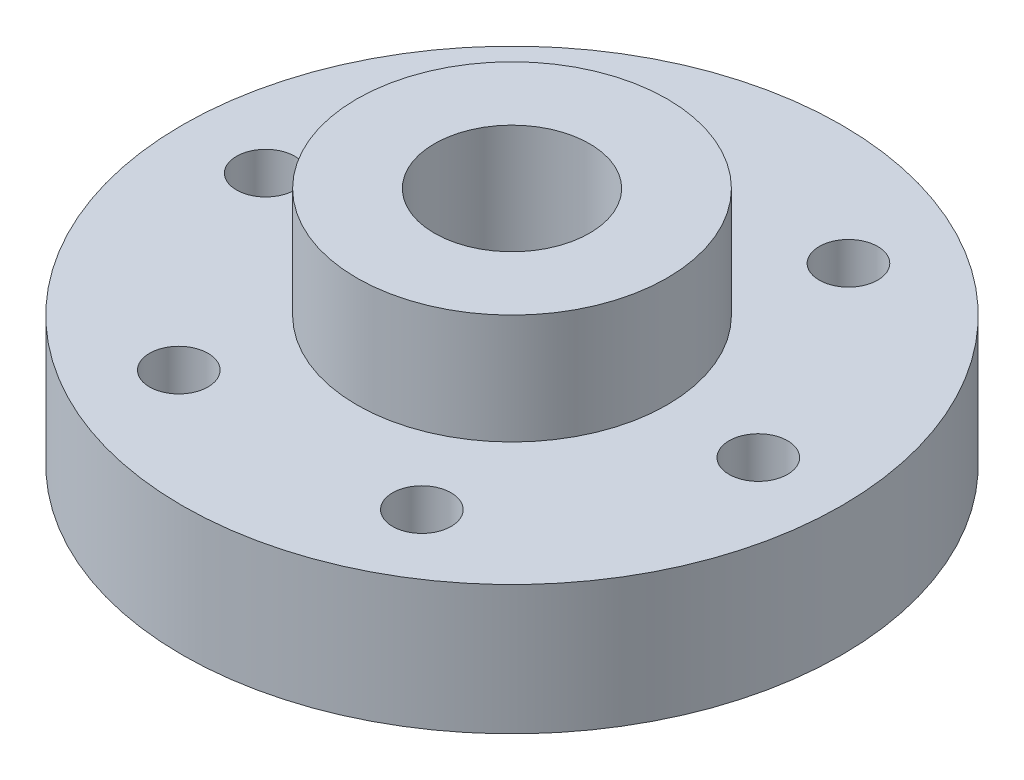
ISO-10303-21;
HEADER;
FILE_DESCRIPTION(('STEP AP214'),'2;1');
FILE_NAME('part.step','',(''),(''),'','','');
FILE_SCHEMA(('AUTOMOTIVE_DESIGN { 1 0 10303 214 1 1 1 1 }'));
ENDSEC;
DATA;
#1=APPLICATION_CONTEXT('core data for automotive mechanical design processes');
#2=APPLICATION_PROTOCOL_DEFINITION('international standard','automotive_design',2000,#1);
#3=PRODUCT_CONTEXT('',#1,'mechanical');
#4=PRODUCT('Part','Part','',(#3));
#5=PRODUCT_RELATED_PRODUCT_CATEGORY('part','',(#4));
#6=PRODUCT_DEFINITION_FORMATION('','',#4);
#7=PRODUCT_DEFINITION_CONTEXT('part definition',#1,'design');
#8=PRODUCT_DEFINITION('design','',#6,#7);
#9=PRODUCT_DEFINITION_SHAPE('','',#8);
#10=(LENGTH_UNIT() NAMED_UNIT(*) SI_UNIT(.MILLI.,.METRE.));
#11=(NAMED_UNIT(*) PLANE_ANGLE_UNIT() SI_UNIT($,.RADIAN.));
#12=(NAMED_UNIT(*) SI_UNIT($,.STERADIAN.) SOLID_ANGLE_UNIT());
#13=UNCERTAINTY_MEASURE_WITH_UNIT(LENGTH_MEASURE(1.E-05),#10,'distance_accuracy_value','');
#14=(GEOMETRIC_REPRESENTATION_CONTEXT(3) GLOBAL_UNCERTAINTY_ASSIGNED_CONTEXT((#13)) GLOBAL_UNIT_ASSIGNED_CONTEXT((#10,
#11,#12)) REPRESENTATION_CONTEXT('',''));
#15=CARTESIAN_POINT('',(0.,0.,0.));
#16=DIRECTION('',(0.,0.,1.));
#17=DIRECTION('',(1.,0.,0.));
#18=AXIS2_PLACEMENT_3D('',#15,#16,#17);
#19=CARTESIAN_POINT('',(0.,5.,0.));
#20=DIRECTION('',(0.,-1.,0.));
#21=DIRECTION('',(0.,0.,-1.));
#22=AXIS2_PLACEMENT_3D('',#19,#20,#21);
#23=CYLINDRICAL_SURFACE('',#22,12.75);
#24=CARTESIAN_POINT('',(0.,5.,0.));
#25=DIRECTION('',(0.,1.,0.));
#26=DIRECTION('',(0.,0.,1.));
#27=AXIS2_PLACEMENT_3D('',#24,#25,#26);
#28=CIRCLE('',#27,12.75);
#29=CARTESIAN_POINT('',(0.,5.,12.75));
#30=VERTEX_POINT('',#29);
#31=EDGE_CURVE('E10',#30,#30,#28,.T.);
#32=ORIENTED_EDGE('',*,*,#31,.F.);
#33=EDGE_LOOP('',(#32));
#34=FACE_BOUND('',#33,.T.);
#35=CARTESIAN_POINT('',(0.,0.,0.));
#36=DIRECTION('',(0.,1.,0.));
#37=DIRECTION('',(0.,0.,1.));
#38=AXIS2_PLACEMENT_3D('',#35,#36,#37);
#39=CIRCLE('',#38,12.75);
#40=CARTESIAN_POINT('',(0.,0.,12.75));
#41=VERTEX_POINT('',#40);
#42=EDGE_CURVE('E36',#41,#41,#39,.T.);
#43=ORIENTED_EDGE('',*,*,#42,.T.);
#44=EDGE_LOOP('',(#43));
#45=FACE_BOUND('',#44,.T.);
#46=ADVANCED_FACE('F33',(#34,#45),#23,.T.);
#47=CARTESIAN_POINT('',(0.,5.,0.));
#48=DIRECTION('',(0.,1.,0.));
#49=DIRECTION('',(0.,0.,1.));
#50=AXIS2_PLACEMENT_3D('',#47,#48,#49);
#51=PLANE('',#50);
#52=CARTESIAN_POINT('',(-4.60967748082197,5.,8.27705861141759));
#53=DIRECTION('',(0.,1.,0.));
#54=DIRECTION('',(0.,0.,1.));
#55=AXIS2_PLACEMENT_3D('',#52,#53,#54);
#56=CIRCLE('',#55,1.13029999999999);
#57=CARTESIAN_POINT('',(-4.60967748082197,5.,9.40735861141757));
#58=VERTEX_POINT('',#57);
#59=EDGE_CURVE('E89',#58,#58,#56,.T.);
#60=ORIENTED_EDGE('',*,*,#59,.F.);
#61=EDGE_LOOP('',(#60));
#62=FACE_BOUND('',#61,.T.);
#63=CARTESIAN_POINT('',(-9.525,5.,0.));
#64=DIRECTION('',(0.,1.,0.));
#65=DIRECTION('',(0.,0.,1.));
#66=AXIS2_PLACEMENT_3D('',#63,#64,#65);
#67=CIRCLE('',#66,1.13029999999999);
#68=CARTESIAN_POINT('',(-9.525,5.,1.13029999999999));
#69=VERTEX_POINT('',#68);
#70=EDGE_CURVE('E83',#69,#69,#67,.T.);
#71=ORIENTED_EDGE('',*,*,#70,.F.);
#72=EDGE_LOOP('',(#71));
#73=FACE_BOUND('',#72,.T.);
#74=CARTESIAN_POINT('',(4.7625,5.,8.24889197104678));
#75=DIRECTION('',(0.,1.,0.));
#76=DIRECTION('',(0.,0.,1.));
#77=AXIS2_PLACEMENT_3D('',#74,#75,#76);
#78=CIRCLE('',#77,1.13029999999999);
#79=CARTESIAN_POINT('',(4.7625,5.,9.37919197104677));
#80=VERTEX_POINT('',#79);
#81=EDGE_CURVE('E77',#80,#80,#78,.T.);
#82=ORIENTED_EDGE('',*,*,#81,.F.);
#83=EDGE_LOOP('',(#82));
#84=FACE_BOUND('',#83,.T.);
#85=CARTESIAN_POINT('',(9.525,5.,0.));
#86=DIRECTION('',(0.,1.,0.));
#87=DIRECTION('',(0.,0.,1.));
#88=AXIS2_PLACEMENT_3D('',#85,#86,#87);
#89=CIRCLE('',#88,1.13029999999999);
#90=CARTESIAN_POINT('',(9.525,5.,1.13029999999999));
#91=VERTEX_POINT('',#90);
#92=EDGE_CURVE('E71',#91,#91,#89,.T.);
#93=ORIENTED_EDGE('',*,*,#92,.F.);
#94=EDGE_LOOP('',(#93));
#95=FACE_BOUND('',#94,.T.);
#96=CARTESIAN_POINT('',(-4.7625,5.,-8.24889197104678));
#97=DIRECTION('',(0.,1.,0.));
#98=DIRECTION('',(0.,0.,1.));
#99=AXIS2_PLACEMENT_3D('',#96,#97,#98);
#100=CIRCLE('',#99,1.13029999999999);
#101=CARTESIAN_POINT('',(-4.7625,5.,-7.11859197104679));
#102=VERTEX_POINT('',#101);
#103=EDGE_CURVE('E65',#102,#102,#100,.T.);
#104=ORIENTED_EDGE('',*,*,#103,.F.);
#105=EDGE_LOOP('',(#104));
#106=FACE_BOUND('',#105,.T.);
#107=CARTESIAN_POINT('',(4.7625,5.,-8.24889197104678));
#108=DIRECTION('',(0.,1.,0.));
#109=DIRECTION('',(0.,0.,1.));
#110=AXIS2_PLACEMENT_3D('',#107,#108,#109);
#111=CIRCLE('',#110,1.13029999999999);
#112=CARTESIAN_POINT('',(4.7625,5.,-7.1185919710468));
#113=VERTEX_POINT('',#112);
#114=EDGE_CURVE('E59',#113,#113,#111,.T.);
#115=ORIENTED_EDGE('',*,*,#114,.F.);
#116=EDGE_LOOP('',(#115));
#117=FACE_BOUND('',#116,.T.);
#118=CARTESIAN_POINT('',(0.,5.,0.));
#119=DIRECTION('',(0.,1.,0.));
#120=DIRECTION('',(0.,0.,1.));
#121=AXIS2_PLACEMENT_3D('',#118,#119,#120);
#122=CIRCLE('',#121,6.);
#123=CARTESIAN_POINT('',(0.,5.,6.));
#124=VERTEX_POINT('',#123);
#125=EDGE_CURVE('E45',#124,#124,#122,.T.);
#126=ORIENTED_EDGE('',*,*,#125,.F.);
#127=EDGE_LOOP('',(#126));
#128=FACE_BOUND('',#127,.T.);
#129=ORIENTED_EDGE('',*,*,#31,.T.);
#130=EDGE_LOOP('',(#129));
#131=FACE_BOUND('',#130,.T.);
#132=ADVANCED_FACE('F95',(#62,#73,#84,#95,#106,#117,#128,#131),#51,.T.);
#133=CARTESIAN_POINT('',(0.,0.,0.));
#134=DIRECTION('',(0.,1.,0.));
#135=DIRECTION('',(0.,0.,1.));
#136=AXIS2_PLACEMENT_3D('',#133,#134,#135);
#137=PLANE('',#136);
#138=CARTESIAN_POINT('',(-4.60967748082197,0.,8.27705861141759));
#139=DIRECTION('',(0.,1.,0.));
#140=DIRECTION('',(0.,0.,1.));
#141=AXIS2_PLACEMENT_3D('',#138,#139,#140);
#142=CIRCLE('',#141,1.1303);
#143=CARTESIAN_POINT('',(-4.60967748082197,0.,9.40735861141758));
#144=VERTEX_POINT('',#143);
#145=EDGE_CURVE('E86',#144,#144,#142,.T.);
#146=ORIENTED_EDGE('',*,*,#145,.T.);
#147=EDGE_LOOP('',(#146));
#148=FACE_BOUND('',#147,.T.);
#149=CARTESIAN_POINT('',(-9.525,0.,0.));
#150=DIRECTION('',(0.,1.,0.));
#151=DIRECTION('',(0.,0.,1.));
#152=AXIS2_PLACEMENT_3D('',#149,#150,#151);
#153=CIRCLE('',#152,1.1303);
#154=CARTESIAN_POINT('',(-9.525,0.,1.1303));
#155=VERTEX_POINT('',#154);
#156=EDGE_CURVE('E80',#155,#155,#153,.T.);
#157=ORIENTED_EDGE('',*,*,#156,.T.);
#158=EDGE_LOOP('',(#157));
#159=FACE_BOUND('',#158,.T.);
#160=CARTESIAN_POINT('',(4.7625,0.,8.24889197104678));
#161=DIRECTION('',(0.,1.,0.));
#162=DIRECTION('',(0.,0.,1.));
#163=AXIS2_PLACEMENT_3D('',#160,#161,#162);
#164=CIRCLE('',#163,1.1303);
#165=CARTESIAN_POINT('',(4.7625,0.,9.37919197104678));
#166=VERTEX_POINT('',#165);
#167=EDGE_CURVE('E74',#166,#166,#164,.T.);
#168=ORIENTED_EDGE('',*,*,#167,.T.);
#169=EDGE_LOOP('',(#168));
#170=FACE_BOUND('',#169,.T.);
#171=CARTESIAN_POINT('',(9.525,0.,0.));
#172=DIRECTION('',(0.,1.,0.));
#173=DIRECTION('',(0.,0.,1.));
#174=AXIS2_PLACEMENT_3D('',#171,#172,#173);
#175=CIRCLE('',#174,1.1303);
#176=CARTESIAN_POINT('',(9.525,0.,1.1303));
#177=VERTEX_POINT('',#176);
#178=EDGE_CURVE('E68',#177,#177,#175,.T.);
#179=ORIENTED_EDGE('',*,*,#178,.T.);
#180=EDGE_LOOP('',(#179));
#181=FACE_BOUND('',#180,.T.);
#182=CARTESIAN_POINT('',(-4.7625,0.,-8.24889197104678));
#183=DIRECTION('',(0.,1.,0.));
#184=DIRECTION('',(0.,0.,1.));
#185=AXIS2_PLACEMENT_3D('',#182,#183,#184);
#186=CIRCLE('',#185,1.1303);
#187=CARTESIAN_POINT('',(-4.7625,0.,-7.11859197104678));
#188=VERTEX_POINT('',#187);
#189=EDGE_CURVE('E62',#188,#188,#186,.T.);
#190=ORIENTED_EDGE('',*,*,#189,.T.);
#191=EDGE_LOOP('',(#190));
#192=FACE_BOUND('',#191,.T.);
#193=CARTESIAN_POINT('',(4.7625,0.,-8.24889197104678));
#194=DIRECTION('',(0.,1.,0.));
#195=DIRECTION('',(0.,0.,1.));
#196=AXIS2_PLACEMENT_3D('',#193,#194,#195);
#197=CIRCLE('',#196,1.1303);
#198=CARTESIAN_POINT('',(4.7625,0.,-7.11859197104678));
#199=VERTEX_POINT('',#198);
#200=EDGE_CURVE('E54',#199,#199,#197,.T.);
#201=ORIENTED_EDGE('',*,*,#200,.T.);
#202=EDGE_LOOP('',(#201));
#203=FACE_BOUND('',#202,.T.);
#204=CARTESIAN_POINT('',(0.,0.,0.));
#205=DIRECTION('',(0.,1.,0.));
#206=DIRECTION('',(0.,0.,1.));
#207=AXIS2_PLACEMENT_3D('',#204,#205,#206);
#208=CIRCLE('',#207,3.);
#209=CARTESIAN_POINT('',(0.,0.,3.));
#210=VERTEX_POINT('',#209);
#211=EDGE_CURVE('E48',#210,#210,#208,.T.);
#212=ORIENTED_EDGE('',*,*,#211,.T.);
#213=EDGE_LOOP('',(#212));
#214=FACE_BOUND('',#213,.T.);
#215=ORIENTED_EDGE('',*,*,#42,.F.);
#216=EDGE_LOOP('',(#215));
#217=FACE_BOUND('',#216,.T.);
#218=ADVANCED_FACE('F98',(#148,#159,#170,#181,#192,#203,#214,#217),#137,.F.);
#219=CARTESIAN_POINT('',(0.,9.25,0.));
#220=DIRECTION('',(0.,-1.,0.));
#221=DIRECTION('',(0.,0.,-1.));
#222=AXIS2_PLACEMENT_3D('',#219,#220,#221);
#223=CYLINDRICAL_SURFACE('',#222,6.);
#224=CARTESIAN_POINT('',(0.,9.25,0.));
#225=DIRECTION('',(0.,1.,0.));
#226=DIRECTION('',(0.,0.,1.));
#227=AXIS2_PLACEMENT_3D('',#224,#225,#226);
#228=CIRCLE('',#227,6.);
#229=CARTESIAN_POINT('',(0.,9.25,6.));
#230=VERTEX_POINT('',#229);
#231=EDGE_CURVE('E43',#230,#230,#228,.T.);
#232=ORIENTED_EDGE('',*,*,#231,.F.);
#233=EDGE_LOOP('',(#232));
#234=FACE_BOUND('',#233,.T.);
#235=ORIENTED_EDGE('',*,*,#125,.T.);
#236=EDGE_LOOP('',(#235));
#237=FACE_BOUND('',#236,.T.);
#238=ADVANCED_FACE('F112',(#234,#237),#223,.T.);
#239=CARTESIAN_POINT('',(0.,9.25,0.));
#240=DIRECTION('',(0.,1.,0.));
#241=DIRECTION('',(0.,0.,1.));
#242=AXIS2_PLACEMENT_3D('',#239,#240,#241);
#243=PLANE('',#242);
#244=CARTESIAN_POINT('',(0.,9.25,0.));
#245=DIRECTION('',(0.,1.,0.));
#246=DIRECTION('',(0.,0.,1.));
#247=AXIS2_PLACEMENT_3D('',#244,#245,#246);
#248=CIRCLE('',#247,3.);
#249=CARTESIAN_POINT('',(0.,9.25,3.));
#250=VERTEX_POINT('',#249);
#251=EDGE_CURVE('E51',#250,#250,#248,.T.);
#252=ORIENTED_EDGE('',*,*,#251,.F.);
#253=EDGE_LOOP('',(#252));
#254=FACE_BOUND('',#253,.T.);
#255=ORIENTED_EDGE('',*,*,#231,.T.);
#256=EDGE_LOOP('',(#255));
#257=FACE_BOUND('',#256,.T.);
#258=ADVANCED_FACE('F114',(#254,#257),#243,.T.);
#259=CARTESIAN_POINT('',(0.,0.,0.));
#260=DIRECTION('',(0.,1.,0.));
#261=DIRECTION('',(0.,0.,1.));
#262=AXIS2_PLACEMENT_3D('',#259,#260,#261);
#263=CYLINDRICAL_SURFACE('',#262,3.);
#264=ORIENTED_EDGE('',*,*,#211,.F.);
#265=EDGE_LOOP('',(#264));
#266=FACE_BOUND('',#265,.T.);
#267=ORIENTED_EDGE('',*,*,#251,.T.);
#268=EDGE_LOOP('',(#267));
#269=FACE_BOUND('',#268,.T.);
#270=ADVANCED_FACE('F121',(#266,#269),#263,.F.);
#271=CARTESIAN_POINT('',(4.7625,5.,-8.24889197104678));
#272=DIRECTION('',(0.,1.,0.));
#273=DIRECTION('',(0.,0.,1.));
#274=AXIS2_PLACEMENT_3D('',#271,#272,#273);
#275=CYLINDRICAL_SURFACE('',#274,1.13029999999999);
#276=ORIENTED_EDGE('',*,*,#200,.F.);
#277=EDGE_LOOP('',(#276));
#278=FACE_BOUND('',#277,.T.);
#279=ORIENTED_EDGE('',*,*,#114,.T.);
#280=EDGE_LOOP('',(#279));
#281=FACE_BOUND('',#280,.T.);
#282=ADVANCED_FACE('F148',(#278,#281),#275,.F.);
#283=CARTESIAN_POINT('',(-4.7625,5.,-8.24889197104678));
#284=DIRECTION('',(0.,1.,0.));
#285=DIRECTION('',(0.,0.,1.));
#286=AXIS2_PLACEMENT_3D('',#283,#284,#285);
#287=CYLINDRICAL_SURFACE('',#286,1.13029999999999);
#288=ORIENTED_EDGE('',*,*,#189,.F.);
#289=EDGE_LOOP('',(#288));
#290=FACE_BOUND('',#289,.T.);
#291=ORIENTED_EDGE('',*,*,#103,.T.);
#292=EDGE_LOOP('',(#291));
#293=FACE_BOUND('',#292,.T.);
#294=ADVANCED_FACE('F154',(#290,#293),#287,.F.);
#295=CARTESIAN_POINT('',(9.525,5.,0.));
#296=DIRECTION('',(0.,1.,0.));
#297=DIRECTION('',(0.,0.,1.));
#298=AXIS2_PLACEMENT_3D('',#295,#296,#297);
#299=CYLINDRICAL_SURFACE('',#298,1.13029999999999);
#300=ORIENTED_EDGE('',*,*,#178,.F.);
#301=EDGE_LOOP('',(#300));
#302=FACE_BOUND('',#301,.T.);
#303=ORIENTED_EDGE('',*,*,#92,.T.);
#304=EDGE_LOOP('',(#303));
#305=FACE_BOUND('',#304,.T.);
#306=ADVANCED_FACE('F166',(#302,#305),#299,.F.);
#307=CARTESIAN_POINT('',(4.7625,5.,8.24889197104678));
#308=DIRECTION('',(0.,1.,0.));
#309=DIRECTION('',(0.,0.,1.));
#310=AXIS2_PLACEMENT_3D('',#307,#308,#309);
#311=CYLINDRICAL_SURFACE('',#310,1.13029999999999);
#312=ORIENTED_EDGE('',*,*,#167,.F.);
#313=EDGE_LOOP('',(#312));
#314=FACE_BOUND('',#313,.T.);
#315=ORIENTED_EDGE('',*,*,#81,.T.);
#316=EDGE_LOOP('',(#315));
#317=FACE_BOUND('',#316,.T.);
#318=ADVANCED_FACE('F177',(#314,#317),#311,.F.);
#319=CARTESIAN_POINT('',(-9.525,5.,0.));
#320=DIRECTION('',(0.,1.,0.));
#321=DIRECTION('',(0.,0.,1.));
#322=AXIS2_PLACEMENT_3D('',#319,#320,#321);
#323=CYLINDRICAL_SURFACE('',#322,1.13029999999999);
#324=ORIENTED_EDGE('',*,*,#156,.F.);
#325=EDGE_LOOP('',(#324));
#326=FACE_BOUND('',#325,.T.);
#327=ORIENTED_EDGE('',*,*,#70,.T.);
#328=EDGE_LOOP('',(#327));
#329=FACE_BOUND('',#328,.T.);
#330=ADVANCED_FACE('F188',(#326,#329),#323,.F.);
#331=CARTESIAN_POINT('',(-4.60967748082197,5.,8.27705861141759));
#332=DIRECTION('',(0.,1.,0.));
#333=DIRECTION('',(0.,0.,1.));
#334=AXIS2_PLACEMENT_3D('',#331,#332,#333);
#335=CYLINDRICAL_SURFACE('',#334,1.13029999999999);
#336=ORIENTED_EDGE('',*,*,#145,.F.);
#337=EDGE_LOOP('',(#336));
#338=FACE_BOUND('',#337,.T.);
#339=ORIENTED_EDGE('',*,*,#59,.T.);
#340=EDGE_LOOP('',(#339));
#341=FACE_BOUND('',#340,.T.);
#342=ADVANCED_FACE('F93',(#338,#341),#335,.F.);
#343=CLOSED_SHELL('',(#46,#132,#218,#238,#258,#270,#282,#294,#306,#318,#330,#342));
#344=MANIFOLD_SOLID_BREP('B2',#343);
#345=ADVANCED_BREP_SHAPE_REPRESENTATION('',(#18,#344),#14);
#346=SHAPE_DEFINITION_REPRESENTATION(#9,#345);
ENDSEC;
END-ISO-10303-21;
